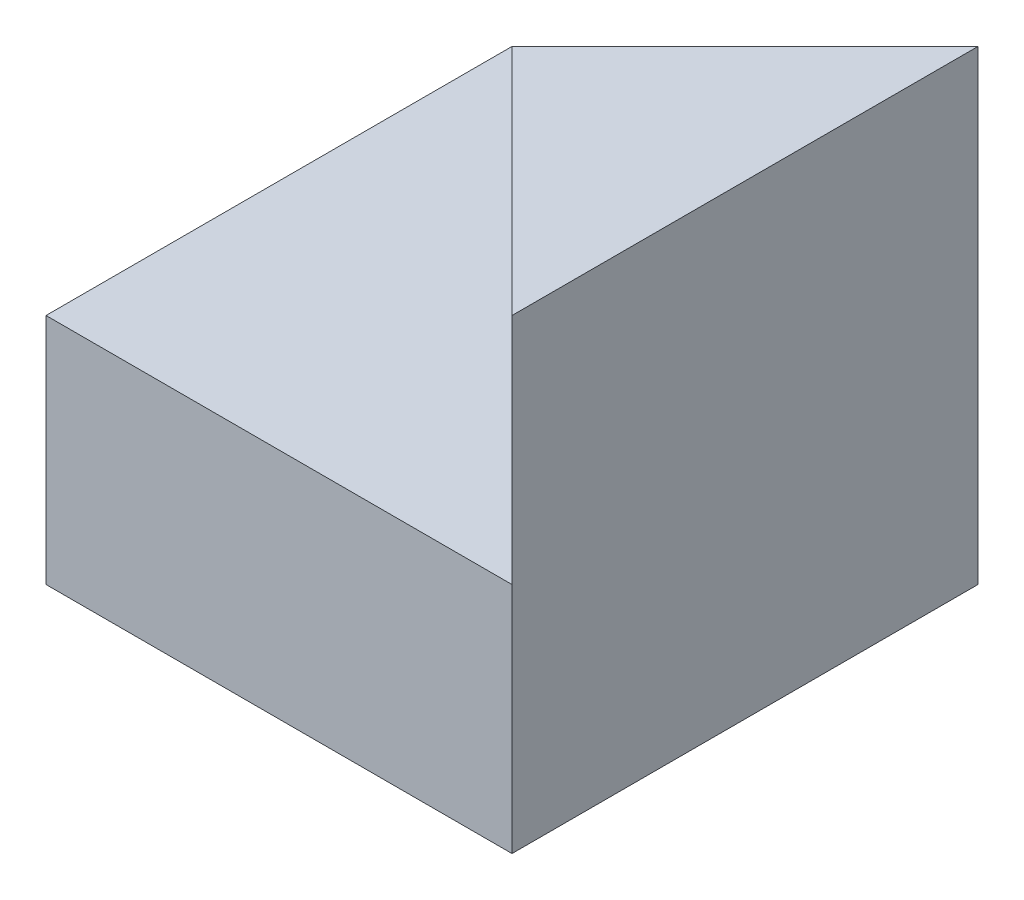
ISO-10303-21;
HEADER;
FILE_DESCRIPTION(('STEP AP214'),'2;1');
FILE_NAME('part.step','',(''),(''),'','','');
FILE_SCHEMA(('AUTOMOTIVE_DESIGN { 1 0 10303 214 1 1 1 1 }'));
ENDSEC;
DATA;
#1=APPLICATION_CONTEXT('core data for automotive mechanical design processes');
#2=APPLICATION_PROTOCOL_DEFINITION('international standard','automotive_design',2000,#1);
#3=PRODUCT_CONTEXT('',#1,'mechanical');
#4=PRODUCT('Part','Part','',(#3));
#5=PRODUCT_RELATED_PRODUCT_CATEGORY('part','',(#4));
#6=PRODUCT_DEFINITION_FORMATION('','',#4);
#7=PRODUCT_DEFINITION_CONTEXT('part definition',#1,'design');
#8=PRODUCT_DEFINITION('design','',#6,#7);
#9=PRODUCT_DEFINITION_SHAPE('','',#8);
#10=(LENGTH_UNIT() NAMED_UNIT(*) SI_UNIT(.MILLI.,.METRE.));
#11=(NAMED_UNIT(*) PLANE_ANGLE_UNIT() SI_UNIT($,.RADIAN.));
#12=(NAMED_UNIT(*) SI_UNIT($,.STERADIAN.) SOLID_ANGLE_UNIT());
#13=UNCERTAINTY_MEASURE_WITH_UNIT(LENGTH_MEASURE(1.E-05),#10,'distance_accuracy_value','');
#14=(GEOMETRIC_REPRESENTATION_CONTEXT(3) GLOBAL_UNCERTAINTY_ASSIGNED_CONTEXT((#13)) GLOBAL_UNIT_ASSIGNED_CONTEXT((#10,
#11,#12)) REPRESENTATION_CONTEXT('',''));
#15=CARTESIAN_POINT('',(0.,0.,0.));
#16=DIRECTION('',(0.,0.,1.));
#17=DIRECTION('',(1.,0.,0.));
#18=AXIS2_PLACEMENT_3D('',#15,#16,#17);
#19=CARTESIAN_POINT('',(0.,0.,40.));
#20=DIRECTION('',(0.,0.,-1.));
#21=DIRECTION('',(-1.,0.,0.));
#22=AXIS2_PLACEMENT_3D('',#19,#20,#21);
#23=PLANE('',#22);
#24=DIRECTION('',(0.,1.,0.));
#25=VECTOR('',#24,1.);
#26=CARTESIAN_POINT('',(40.,0.,40.));
#27=LINE('',#26,#25);
#28=CARTESIAN_POINT('',(40.,0.,40.));
#29=VERTEX_POINT('',#28);
#30=CARTESIAN_POINT('',(40.,20.,40.));
#31=VERTEX_POINT('',#30);
#32=EDGE_CURVE('E128',#29,#31,#27,.T.);
#33=ORIENTED_EDGE('',*,*,#32,.T.);
#34=DIRECTION('',(-1.,0.,0.));
#35=VECTOR('',#34,1.);
#36=CARTESIAN_POINT('',(0.,20.,40.));
#37=LINE('',#36,#35);
#38=CARTESIAN_POINT('',(0.,20.,40.));
#39=VERTEX_POINT('',#38);
#40=EDGE_CURVE('E38',#31,#39,#37,.T.);
#41=ORIENTED_EDGE('',*,*,#40,.T.);
#42=DIRECTION('',(0.,-1.,0.));
#43=VECTOR('',#42,1.);
#44=CARTESIAN_POINT('',(0.,0.,40.));
#45=LINE('',#44,#43);
#46=CARTESIAN_POINT('',(0.,0.,40.));
#47=VERTEX_POINT('',#46);
#48=EDGE_CURVE('E125',#39,#47,#45,.T.);
#49=ORIENTED_EDGE('',*,*,#48,.T.);
#50=DIRECTION('',(1.,0.,0.));
#51=VECTOR('',#50,1.);
#52=CARTESIAN_POINT('',(0.,0.,40.));
#53=LINE('',#52,#51);
#54=EDGE_CURVE('E83',#47,#29,#53,.T.);
#55=ORIENTED_EDGE('',*,*,#54,.T.);
#56=EDGE_LOOP('',(#33,#41,#49,#55));
#57=FACE_BOUND('',#56,.T.);
#58=ADVANCED_FACE('F34',(#57),#23,.F.);
#59=CARTESIAN_POINT('',(40.,40.,0.));
#60=DIRECTION('',(0.,1.,0.));
#61=DIRECTION('',(-1.,0.,0.));
#62=AXIS2_PLACEMENT_3D('',#59,#60,#61);
#63=PLANE('',#62);
#64=DIRECTION('',(0.707106781186548,0.,-0.707106781186548));
#65=VECTOR('',#64,1.);
#66=CARTESIAN_POINT('',(20.,40.,20.));
#67=LINE('',#66,#65);
#68=CARTESIAN_POINT('',(20.,40.,20.));
#69=VERTEX_POINT('',#68);
#70=CARTESIAN_POINT('',(40.,40.,0.));
#71=VERTEX_POINT('',#70);
#72=EDGE_CURVE('E109',#69,#71,#67,.T.);
#73=ORIENTED_EDGE('',*,*,#72,.F.);
#74=DIRECTION('',(0.707106781186548,0.,0.707106781186548));
#75=VECTOR('',#74,1.);
#76=CARTESIAN_POINT('',(0.,40.,0.));
#77=LINE('',#76,#75);
#78=CARTESIAN_POINT('',(40.,40.,40.));
#79=VERTEX_POINT('',#78);
#80=EDGE_CURVE('E52',#69,#79,#77,.T.);
#81=ORIENTED_EDGE('',*,*,#80,.T.);
#82=DIRECTION('',(0.,0.,1.));
#83=VECTOR('',#82,1.);
#84=CARTESIAN_POINT('',(40.,40.,0.));
#85=LINE('',#84,#83);
#86=EDGE_CURVE('E108',#71,#79,#85,.T.);
#87=ORIENTED_EDGE('',*,*,#86,.F.);
#88=EDGE_LOOP('',(#73,#81,#87));
#89=FACE_BOUND('',#88,.T.);
#90=ADVANCED_FACE('F107',(#89),#63,.T.);
#91=CARTESIAN_POINT('',(0.,0.,0.));
#92=DIRECTION('',(0.,0.,-1.));
#93=DIRECTION('',(-1.,0.,0.));
#94=AXIS2_PLACEMENT_3D('',#91,#92,#93);
#95=PLANE('',#94);
#96=DIRECTION('',(-1.,0.,0.));
#97=VECTOR('',#96,1.);
#98=CARTESIAN_POINT('',(0.,20.,0.));
#99=LINE('',#98,#97);
#100=CARTESIAN_POINT('',(40.,20.,0.));
#101=VERTEX_POINT('',#100);
#102=CARTESIAN_POINT('',(0.,20.,0.));
#103=VERTEX_POINT('',#102);
#104=EDGE_CURVE('E78',#101,#103,#99,.T.);
#105=ORIENTED_EDGE('',*,*,#104,.F.);
#106=DIRECTION('',(0.,1.,0.));
#107=VECTOR('',#106,1.);
#108=CARTESIAN_POINT('',(40.,0.,0.));
#109=LINE('',#108,#107);
#110=CARTESIAN_POINT('',(40.,0.,0.));
#111=VERTEX_POINT('',#110);
#112=EDGE_CURVE('E132',#111,#101,#109,.T.);
#113=ORIENTED_EDGE('',*,*,#112,.F.);
#114=DIRECTION('',(1.,0.,0.));
#115=VECTOR('',#114,1.);
#116=CARTESIAN_POINT('',(0.,0.,0.));
#117=LINE('',#116,#115);
#118=CARTESIAN_POINT('',(0.,0.,0.));
#119=VERTEX_POINT('',#118);
#120=EDGE_CURVE('E119',#119,#111,#117,.T.);
#121=ORIENTED_EDGE('',*,*,#120,.F.);
#122=DIRECTION('',(0.,-1.,0.));
#123=VECTOR('',#122,1.);
#124=CARTESIAN_POINT('',(0.,0.,0.));
#125=LINE('',#124,#123);
#126=EDGE_CURVE('E116',#103,#119,#125,.T.);
#127=ORIENTED_EDGE('',*,*,#126,.F.);
#128=EDGE_LOOP('',(#105,#113,#121,#127));
#129=FACE_BOUND('',#128,.T.);
#130=ADVANCED_FACE('F145',(#129),#95,.T.);
#131=CARTESIAN_POINT('',(0.,20.,40.));
#132=DIRECTION('',(0.,-1.,0.));
#133=DIRECTION('',(0.,0.,-1.));
#134=AXIS2_PLACEMENT_3D('',#131,#132,#133);
#135=PLANE('',#134);
#136=ORIENTED_EDGE('',*,*,#40,.F.);
#137=DIRECTION('',(0.707106781186548,0.,0.707106781186548));
#138=VECTOR('',#137,1.);
#139=CARTESIAN_POINT('',(0.,20.,0.));
#140=LINE('',#139,#138);
#141=CARTESIAN_POINT('',(20.,20.,20.));
#142=VERTEX_POINT('',#141);
#143=EDGE_CURVE('E99',#142,#31,#140,.T.);
#144=ORIENTED_EDGE('',*,*,#143,.F.);
#145=DIRECTION('',(0.707106781186548,0.,-0.707106781186548));
#146=VECTOR('',#145,1.);
#147=CARTESIAN_POINT('',(20.,20.,20.));
#148=LINE('',#147,#146);
#149=EDGE_CURVE('E169',#142,#101,#148,.T.);
#150=ORIENTED_EDGE('',*,*,#149,.T.);
#151=ORIENTED_EDGE('',*,*,#104,.T.);
#152=DIRECTION('',(0.,0.,-1.));
#153=VECTOR('',#152,1.);
#154=CARTESIAN_POINT('',(0.,20.,40.));
#155=LINE('',#154,#153);
#156=EDGE_CURVE('E136',#39,#103,#155,.T.);
#157=ORIENTED_EDGE('',*,*,#156,.F.);
#158=EDGE_LOOP('',(#136,#144,#150,#151,#157));
#159=FACE_BOUND('',#158,.T.);
#160=ADVANCED_FACE('F154',(#159),#135,.F.);
#161=CARTESIAN_POINT('',(0.,0.,40.));
#162=DIRECTION('',(1.,0.,0.));
#163=DIRECTION('',(0.,0.,-1.));
#164=AXIS2_PLACEMENT_3D('',#161,#162,#163);
#165=PLANE('',#164);
#166=ORIENTED_EDGE('',*,*,#126,.T.);
#167=DIRECTION('',(0.,0.,-1.));
#168=VECTOR('',#167,1.);
#169=CARTESIAN_POINT('',(0.,0.,40.));
#170=LINE('',#169,#168);
#171=EDGE_CURVE('E12',#47,#119,#170,.T.);
#172=ORIENTED_EDGE('',*,*,#171,.F.);
#173=ORIENTED_EDGE('',*,*,#48,.F.);
#174=ORIENTED_EDGE('',*,*,#156,.T.);
#175=EDGE_LOOP('',(#166,#172,#173,#174));
#176=FACE_BOUND('',#175,.T.);
#177=ADVANCED_FACE('F36',(#176),#165,.F.);
#178=CARTESIAN_POINT('',(0.,0.,40.));
#179=DIRECTION('',(0.,1.,0.));
#180=DIRECTION('',(0.,0.,1.));
#181=AXIS2_PLACEMENT_3D('',#178,#179,#180);
#182=PLANE('',#181);
#183=ORIENTED_EDGE('',*,*,#120,.T.);
#184=DIRECTION('',(0.,0.,-1.));
#185=VECTOR('',#184,1.);
#186=CARTESIAN_POINT('',(40.,0.,40.));
#187=LINE('',#186,#185);
#188=EDGE_CURVE('E44',#29,#111,#187,.T.);
#189=ORIENTED_EDGE('',*,*,#188,.F.);
#190=ORIENTED_EDGE('',*,*,#54,.F.);
#191=ORIENTED_EDGE('',*,*,#171,.T.);
#192=EDGE_LOOP('',(#183,#189,#190,#191));
#193=FACE_BOUND('',#192,.T.);
#194=ADVANCED_FACE('F146',(#193),#182,.F.);
#195=CARTESIAN_POINT('',(40.,0.,40.));
#196=DIRECTION('',(-1.,0.,0.));
#197=DIRECTION('',(0.,0.,1.));
#198=AXIS2_PLACEMENT_3D('',#195,#196,#197);
#199=PLANE('',#198);
#200=ORIENTED_EDGE('',*,*,#112,.T.);
#201=DIRECTION('',(0.,1.,0.));
#202=VECTOR('',#201,1.);
#203=CARTESIAN_POINT('',(40.,20.,0.));
#204=LINE('',#203,#202);
#205=EDGE_CURVE('E115',#101,#71,#204,.T.);
#206=ORIENTED_EDGE('',*,*,#205,.T.);
#207=ORIENTED_EDGE('',*,*,#86,.T.);
#208=DIRECTION('',(0.,1.,0.));
#209=VECTOR('',#208,1.);
#210=CARTESIAN_POINT('',(40.,20.,40.));
#211=LINE('',#210,#209);
#212=EDGE_CURVE('E96',#31,#79,#211,.T.);
#213=ORIENTED_EDGE('',*,*,#212,.F.);
#214=ORIENTED_EDGE('',*,*,#32,.F.);
#215=ORIENTED_EDGE('',*,*,#188,.T.);
#216=EDGE_LOOP('',(#200,#206,#207,#213,#214,#215));
#217=FACE_BOUND('',#216,.T.);
#218=ADVANCED_FACE('F113',(#217),#199,.F.);
#219=CARTESIAN_POINT('',(20.,20.,20.));
#220=DIRECTION('',(0.707106781186548,0.,0.707106781186548));
#221=DIRECTION('',(0.707106781186548,0.,-0.707106781186548));
#222=AXIS2_PLACEMENT_3D('',#219,#220,#221);
#223=PLANE('',#222);
#224=ORIENTED_EDGE('',*,*,#72,.T.);
#225=ORIENTED_EDGE('',*,*,#205,.F.);
#226=ORIENTED_EDGE('',*,*,#149,.F.);
#227=DIRECTION('',(0.,1.,0.));
#228=VECTOR('',#227,1.);
#229=CARTESIAN_POINT('',(20.,20.,20.));
#230=LINE('',#229,#228);
#231=EDGE_CURVE('E121',#142,#69,#230,.T.);
#232=ORIENTED_EDGE('',*,*,#231,.T.);
#233=EDGE_LOOP('',(#224,#225,#226,#232));
#234=FACE_BOUND('',#233,.T.);
#235=ADVANCED_FACE('F152',(#234),#223,.F.);
#236=CARTESIAN_POINT('',(0.,20.,0.));
#237=DIRECTION('',(-0.707106781186548,0.,0.707106781186548));
#238=DIRECTION('',(0.707106781186548,0.,0.707106781186548));
#239=AXIS2_PLACEMENT_3D('',#236,#237,#238);
#240=PLANE('',#239);
#241=ORIENTED_EDGE('',*,*,#80,.F.);
#242=ORIENTED_EDGE('',*,*,#231,.F.);
#243=ORIENTED_EDGE('',*,*,#143,.T.);
#244=ORIENTED_EDGE('',*,*,#212,.T.);
#245=EDGE_LOOP('',(#241,#242,#243,#244));
#246=FACE_BOUND('',#245,.T.);
#247=ADVANCED_FACE('F97',(#246),#240,.T.);
#248=CLOSED_SHELL('',(#58,#90,#130,#160,#177,#194,#218,#235,#247));
#249=MANIFOLD_SOLID_BREP('B2',#248);
#250=ADVANCED_BREP_SHAPE_REPRESENTATION('',(#18,#249),#14);
#251=SHAPE_DEFINITION_REPRESENTATION(#9,#250);
ENDSEC;
END-ISO-10303-21;
